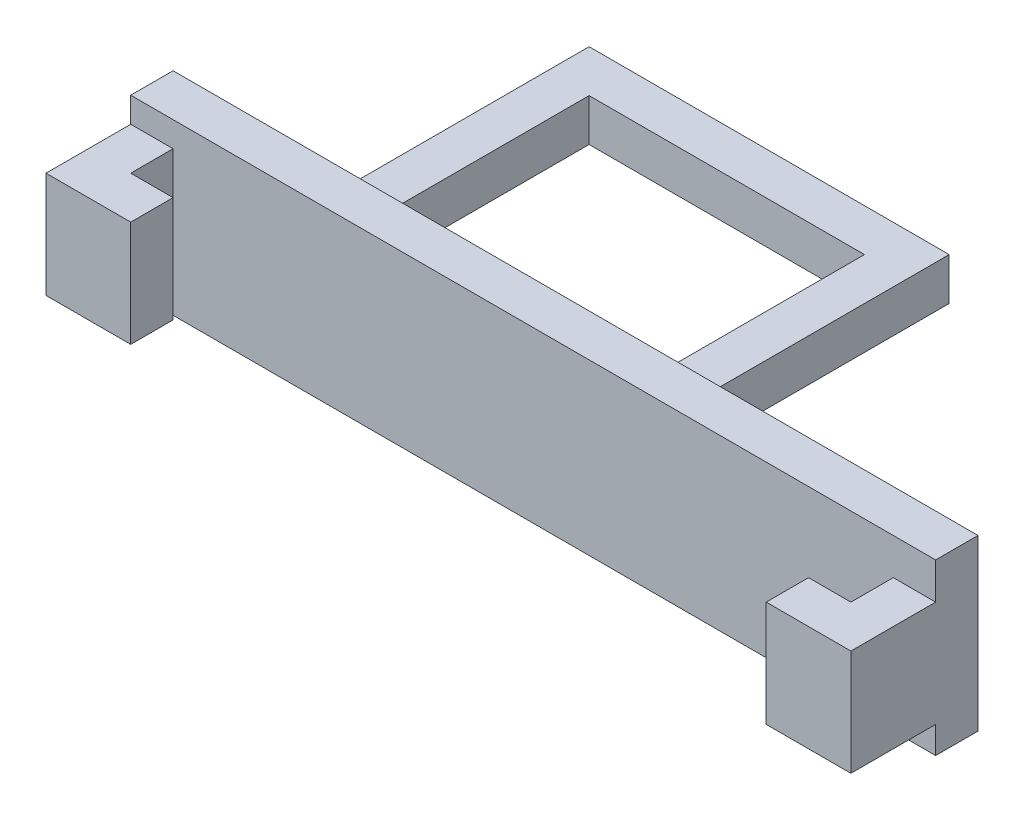
ISO-10303-21;
HEADER;
FILE_DESCRIPTION(('STEP AP214'),'2;1');
FILE_NAME('part.step','',(''),(''),'','','');
FILE_SCHEMA(('AUTOMOTIVE_DESIGN { 1 0 10303 214 1 1 1 1 }'));
ENDSEC;
DATA;
#1=APPLICATION_CONTEXT('core data for automotive mechanical design processes');
#2=APPLICATION_PROTOCOL_DEFINITION('international standard','automotive_design',2000,#1);
#3=PRODUCT_CONTEXT('',#1,'mechanical');
#4=PRODUCT('Part','Part','',(#3));
#5=PRODUCT_RELATED_PRODUCT_CATEGORY('part','',(#4));
#6=PRODUCT_DEFINITION_FORMATION('','',#4);
#7=PRODUCT_DEFINITION_CONTEXT('part definition',#1,'design');
#8=PRODUCT_DEFINITION('design','',#6,#7);
#9=PRODUCT_DEFINITION_SHAPE('','',#8);
#10=(LENGTH_UNIT() NAMED_UNIT(*) SI_UNIT(.MILLI.,.METRE.));
#11=(NAMED_UNIT(*) PLANE_ANGLE_UNIT() SI_UNIT($,.RADIAN.));
#12=(NAMED_UNIT(*) SI_UNIT($,.STERADIAN.) SOLID_ANGLE_UNIT());
#13=UNCERTAINTY_MEASURE_WITH_UNIT(LENGTH_MEASURE(1.E-05),#10,'distance_accuracy_value','');
#14=(GEOMETRIC_REPRESENTATION_CONTEXT(3) GLOBAL_UNCERTAINTY_ASSIGNED_CONTEXT((#13)) GLOBAL_UNIT_ASSIGNED_CONTEXT((#10,
#11,#12)) REPRESENTATION_CONTEXT('',''));
#15=CARTESIAN_POINT('',(0.,0.,0.));
#16=DIRECTION('',(0.,0.,1.));
#17=DIRECTION('',(1.,0.,0.));
#18=AXIS2_PLACEMENT_3D('',#15,#16,#17);
#19=CARTESIAN_POINT('',(30.3600841041871,0.,0.));
#20=DIRECTION('',(1.,0.,0.));
#21=DIRECTION('',(0.,0.,-1.));
#22=AXIS2_PLACEMENT_3D('',#19,#20,#21);
#23=PLANE('',#22);
#24=DIRECTION('',(0.,-1.,0.));
#25=VECTOR('',#24,1.);
#26=CARTESIAN_POINT('',(30.3600841041871,3.47182563135917,19.));
#27=LINE('',#26,#25);
#28=CARTESIAN_POINT('',(30.3600841041871,3.47182563135917,19.));
#29=VERTEX_POINT('',#28);
#30=CARTESIAN_POINT('',(30.3600841041871,-1.52817436864083,19.));
#31=VERTEX_POINT('',#30);
#32=EDGE_CURVE('E217',#29,#31,#27,.T.);
#33=ORIENTED_EDGE('',*,*,#32,.F.);
#34=DIRECTION('',(0.,0.,1.));
#35=VECTOR('',#34,1.);
#36=CARTESIAN_POINT('',(30.3600841041871,3.47182563135917,17.));
#37=LINE('',#36,#35);
#38=CARTESIAN_POINT('',(30.3600841041871,3.47182563135917,17.));
#39=VERTEX_POINT('',#38);
#40=EDGE_CURVE('E222',#39,#29,#37,.T.);
#41=ORIENTED_EDGE('',*,*,#40,.F.);
#42=DIRECTION('',(0.,1.,0.));
#43=VECTOR('',#42,1.);
#44=CARTESIAN_POINT('',(30.3600841041871,3.47182563135917,17.));
#45=LINE('',#44,#43);
#46=CARTESIAN_POINT('',(30.3600841041871,-1.52817436864083,17.));
#47=VERTEX_POINT('',#46);
#48=EDGE_CURVE('E271',#47,#39,#45,.T.);
#49=ORIENTED_EDGE('',*,*,#48,.F.);
#50=DIRECTION('',(0.,0.,-1.));
#51=VECTOR('',#50,1.);
#52=CARTESIAN_POINT('',(30.3600841041871,-1.52817436864083,17.));
#53=LINE('',#52,#51);
#54=EDGE_CURVE('E268',#31,#47,#53,.T.);
#55=ORIENTED_EDGE('',*,*,#54,.F.);
#56=EDGE_LOOP('',(#33,#41,#49,#55));
#57=FACE_BOUND('',#56,.T.);
#58=ADVANCED_FACE('F33',(#57),#23,.F.);
#59=CARTESIAN_POINT('',(-3.63991589581292,0.,0.));
#60=DIRECTION('',(-1.,0.,0.));
#61=DIRECTION('',(0.,0.,1.));
#62=AXIS2_PLACEMENT_3D('',#59,#60,#61);
#63=PLANE('',#62);
#64=DIRECTION('',(0.,1.,0.));
#65=VECTOR('',#64,1.);
#66=CARTESIAN_POINT('',(-3.63991589581292,4.00838379401158,19.));
#67=LINE('',#66,#65);
#68=CARTESIAN_POINT('',(-3.63991589581292,-0.99161620598842,19.));
#69=VERTEX_POINT('',#68);
#70=CARTESIAN_POINT('',(-3.63991589581292,4.00838379401158,19.));
#71=VERTEX_POINT('',#70);
#72=EDGE_CURVE('E50',#69,#71,#67,.T.);
#73=ORIENTED_EDGE('',*,*,#72,.F.);
#74=DIRECTION('',(0.,0.,1.));
#75=VECTOR('',#74,1.);
#76=CARTESIAN_POINT('',(-3.63991589581292,-0.991616205988421,17.));
#77=LINE('',#76,#75);
#78=CARTESIAN_POINT('',(-3.63991589581292,-0.991616205988421,17.));
#79=VERTEX_POINT('',#78);
#80=EDGE_CURVE('E244',#79,#69,#77,.T.);
#81=ORIENTED_EDGE('',*,*,#80,.F.);
#82=DIRECTION('',(0.,-1.,0.));
#83=VECTOR('',#82,1.);
#84=CARTESIAN_POINT('',(-3.63991589581292,-0.991616205988421,17.));
#85=LINE('',#84,#83);
#86=CARTESIAN_POINT('',(-3.63991589581292,4.00838379401158,17.));
#87=VERTEX_POINT('',#86);
#88=EDGE_CURVE('E248',#87,#79,#85,.T.);
#89=ORIENTED_EDGE('',*,*,#88,.F.);
#90=DIRECTION('',(0.,0.,-1.));
#91=VECTOR('',#90,1.);
#92=CARTESIAN_POINT('',(-3.63991589581292,4.00838379401158,17.));
#93=LINE('',#92,#91);
#94=EDGE_CURVE('E57',#71,#87,#93,.T.);
#95=ORIENTED_EDGE('',*,*,#94,.F.);
#96=EDGE_LOOP('',(#73,#81,#89,#95));
#97=FACE_BOUND('',#96,.T.);
#98=ADVANCED_FACE('F459',(#97),#63,.F.);
#99=CARTESIAN_POINT('',(0.,0.,17.));
#100=DIRECTION('',(0.,0.,-1.));
#101=DIRECTION('',(-1.,0.,0.));
#102=AXIS2_PLACEMENT_3D('',#99,#100,#101);
#103=PLANE('',#102);
#104=ORIENTED_EDGE('',*,*,#88,.T.);
#105=DIRECTION('',(-1.,0.,0.));
#106=VECTOR('',#105,1.);
#107=CARTESIAN_POINT('',(-3.63991589581292,-0.991616205988421,17.));
#108=LINE('',#107,#106);
#109=CARTESIAN_POINT('',(-5.63991589581292,-0.991616205988421,17.));
#110=VERTEX_POINT('',#109);
#111=EDGE_CURVE('E258',#79,#110,#108,.T.);
#112=ORIENTED_EDGE('',*,*,#111,.T.);
#113=DIRECTION('',(0.,-1.,0.));
#114=VECTOR('',#113,1.);
#115=CARTESIAN_POINT('',(-5.63991589581292,5.19652768965261,17.));
#116=LINE('',#115,#114);
#117=CARTESIAN_POINT('',(-5.63991589581292,-2.80347231034739,17.));
#118=VERTEX_POINT('',#117);
#119=EDGE_CURVE('E728',#110,#118,#116,.T.);
#120=ORIENTED_EDGE('',*,*,#119,.T.);
#121=DIRECTION('',(1.,0.,0.));
#122=VECTOR('',#121,1.);
#123=CARTESIAN_POINT('',(-5.63991589581292,-2.80347231034739,17.));
#124=LINE('',#123,#122);
#125=CARTESIAN_POINT('',(32.3600841041871,-2.80347231034739,17.));
#126=VERTEX_POINT('',#125);
#127=EDGE_CURVE('E308',#118,#126,#124,.T.);
#128=ORIENTED_EDGE('',*,*,#127,.T.);
#129=DIRECTION('',(0.,1.,0.));
#130=VECTOR('',#129,1.);
#131=CARTESIAN_POINT('',(32.3600841041871,5.19652768965261,17.));
#132=LINE('',#131,#130);
#133=CARTESIAN_POINT('',(32.3600841041871,-1.52817436864083,17.));
#134=VERTEX_POINT('',#133);
#135=EDGE_CURVE('E300',#126,#134,#132,.T.);
#136=ORIENTED_EDGE('',*,*,#135,.T.);
#137=DIRECTION('',(1.,0.,0.));
#138=VECTOR('',#137,1.);
#139=CARTESIAN_POINT('',(30.3600841041871,-1.52817436864083,17.));
#140=LINE('',#139,#138);
#141=EDGE_CURVE('E288',#47,#134,#140,.T.);
#142=ORIENTED_EDGE('',*,*,#141,.F.);
#143=ORIENTED_EDGE('',*,*,#48,.T.);
#144=DIRECTION('',(1.,0.,0.));
#145=VECTOR('',#144,1.);
#146=CARTESIAN_POINT('',(30.3600841041871,3.47182563135917,17.));
#147=LINE('',#146,#145);
#148=CARTESIAN_POINT('',(32.3600841041871,3.47182563135917,17.));
#149=VERTEX_POINT('',#148);
#150=EDGE_CURVE('E283',#39,#149,#147,.T.);
#151=ORIENTED_EDGE('',*,*,#150,.T.);
#152=CARTESIAN_POINT('',(32.3600841041871,5.19652768965261,17.));
#153=VERTEX_POINT('',#152);
#154=EDGE_CURVE('E311',#149,#153,#132,.T.);
#155=ORIENTED_EDGE('',*,*,#154,.T.);
#156=DIRECTION('',(-1.,0.,0.));
#157=VECTOR('',#156,1.);
#158=CARTESIAN_POINT('',(-5.63991589581292,5.19652768965261,17.));
#159=LINE('',#158,#157);
#160=CARTESIAN_POINT('',(-5.63991589581292,5.19652768965261,17.));
#161=VERTEX_POINT('',#160);
#162=EDGE_CURVE('E334',#153,#161,#159,.T.);
#163=ORIENTED_EDGE('',*,*,#162,.T.);
#164=CARTESIAN_POINT('',(-5.63991589581292,4.00838379401158,17.));
#165=VERTEX_POINT('',#164);
#166=EDGE_CURVE('E726',#161,#165,#116,.T.);
#167=ORIENTED_EDGE('',*,*,#166,.T.);
#168=DIRECTION('',(-1.,0.,0.));
#169=VECTOR('',#168,1.);
#170=CARTESIAN_POINT('',(-3.63991589581292,4.00838379401158,17.));
#171=LINE('',#170,#169);
#172=EDGE_CURVE('E262',#87,#165,#171,.T.);
#173=ORIENTED_EDGE('',*,*,#172,.F.);
#174=EDGE_LOOP('',(#104,#112,#120,#128,#136,#142,#143,#151,#155,#163,#167,#173));
#175=FACE_BOUND('',#174,.T.);
#176=ADVANCED_FACE('F306',(#175),#103,.F.);
#177=CARTESIAN_POINT('',(16.,1.,2.));
#178=DIRECTION('',(0.,0.,-1.));
#179=DIRECTION('',(0.,1.,0.));
#180=AXIS2_PLACEMENT_3D('',#177,#178,#179);
#181=PLANE('',#180);
#182=DIRECTION('',(0.,-1.,0.));
#183=VECTOR('',#182,1.);
#184=CARTESIAN_POINT('',(14.,0.999999999999999,2.));
#185=LINE('',#184,#183);
#186=CARTESIAN_POINT('',(14.,0.999999999999999,2.));
#187=VERTEX_POINT('',#186);
#188=CARTESIAN_POINT('',(14.,-1.,2.));
#189=VERTEX_POINT('',#188);
#190=EDGE_CURVE('E343',#187,#189,#185,.T.);
#191=ORIENTED_EDGE('',*,*,#190,.F.);
#192=DIRECTION('',(-1.,0.,0.));
#193=VECTOR('',#192,1.);
#194=CARTESIAN_POINT('',(16.,1.,2.));
#195=LINE('',#194,#193);
#196=CARTESIAN_POINT('',(1.,1.,2.));
#197=VERTEX_POINT('',#196);
#198=EDGE_CURVE('E319',#187,#197,#195,.T.);
#199=ORIENTED_EDGE('',*,*,#198,.T.);
#200=DIRECTION('',(0.,-1.,0.));
#201=VECTOR('',#200,1.);
#202=CARTESIAN_POINT('',(1.,1.,2.));
#203=LINE('',#202,#201);
#204=CARTESIAN_POINT('',(1.,-1.,2.));
#205=VERTEX_POINT('',#204);
#206=EDGE_CURVE('E361',#197,#205,#203,.T.);
#207=ORIENTED_EDGE('',*,*,#206,.T.);
#208=DIRECTION('',(-1.,0.,0.));
#209=VECTOR('',#208,1.);
#210=CARTESIAN_POINT('',(16.,-1.,2.));
#211=LINE('',#210,#209);
#212=EDGE_CURVE('E370',#189,#205,#211,.T.);
#213=ORIENTED_EDGE('',*,*,#212,.F.);
#214=EDGE_LOOP('',(#191,#199,#207,#213));
#215=FACE_BOUND('',#214,.T.);
#216=ADVANCED_FACE('F435',(#215),#181,.F.);
#217=CARTESIAN_POINT('',(1.,-1.,15.));
#218=DIRECTION('',(-1.,0.,0.));
#219=DIRECTION('',(0.,0.,1.));
#220=AXIS2_PLACEMENT_3D('',#217,#218,#219);
#221=PLANE('',#220);
#222=ORIENTED_EDGE('',*,*,#206,.F.);
#223=DIRECTION('',(0.,0.,-1.));
#224=VECTOR('',#223,1.);
#225=CARTESIAN_POINT('',(1.,1.,15.));
#226=LINE('',#225,#224);
#227=CARTESIAN_POINT('',(1.,1.,15.));
#228=VERTEX_POINT('',#227);
#229=EDGE_CURVE('E11',#228,#197,#226,.T.);
#230=ORIENTED_EDGE('',*,*,#229,.F.);
#231=DIRECTION('',(0.,1.,0.));
#232=VECTOR('',#231,1.);
#233=CARTESIAN_POINT('',(1.,-1.,15.));
#234=LINE('',#233,#232);
#235=CARTESIAN_POINT('',(1.,-1.,15.));
#236=VERTEX_POINT('',#235);
#237=EDGE_CURVE('E373',#236,#228,#234,.T.);
#238=ORIENTED_EDGE('',*,*,#237,.F.);
#239=DIRECTION('',(0.,0.,-1.));
#240=VECTOR('',#239,1.);
#241=CARTESIAN_POINT('',(1.,-1.,15.));
#242=LINE('',#241,#240);
#243=EDGE_CURVE('E379',#236,#205,#242,.T.);
#244=ORIENTED_EDGE('',*,*,#243,.T.);
#245=EDGE_LOOP('',(#222,#230,#238,#244));
#246=FACE_BOUND('',#245,.T.);
#247=ADVANCED_FACE('F35',(#246),#221,.F.);
#248=CARTESIAN_POINT('',(-1.,1.,15.));
#249=DIRECTION('',(0.,-1.,0.));
#250=DIRECTION('',(0.,0.,-1.));
#251=AXIS2_PLACEMENT_3D('',#248,#249,#250);
#252=PLANE('',#251);
#253=DIRECTION('',(-1.,0.,0.));
#254=VECTOR('',#253,1.);
#255=CARTESIAN_POINT('',(-1.,1.,0.));
#256=LINE('',#255,#254);
#257=CARTESIAN_POINT('',(16.,1.,0.));
#258=VERTEX_POINT('',#257);
#259=CARTESIAN_POINT('',(-1.,1.,0.));
#260=VERTEX_POINT('',#259);
#261=EDGE_CURVE('E387',#258,#260,#256,.T.);
#262=ORIENTED_EDGE('',*,*,#261,.T.);
#263=DIRECTION('',(0.,0.,-1.));
#264=VECTOR('',#263,1.);
#265=CARTESIAN_POINT('',(-1.,1.,15.));
#266=LINE('',#265,#264);
#267=CARTESIAN_POINT('',(-1.,1.,15.));
#268=VERTEX_POINT('',#267);
#269=EDGE_CURVE('E42',#268,#260,#266,.T.);
#270=ORIENTED_EDGE('',*,*,#269,.F.);
#271=DIRECTION('',(-1.,0.,0.));
#272=VECTOR('',#271,1.);
#273=CARTESIAN_POINT('',(-1.,1.,15.));
#274=LINE('',#273,#272);
#275=EDGE_CURVE('E439',#228,#268,#274,.T.);
#276=ORIENTED_EDGE('',*,*,#275,.F.);
#277=ORIENTED_EDGE('',*,*,#229,.T.);
#278=ORIENTED_EDGE('',*,*,#198,.F.);
#279=DIRECTION('',(0.,0.,-1.));
#280=VECTOR('',#279,1.);
#281=CARTESIAN_POINT('',(14.,0.999999999999999,13.));
#282=LINE('',#281,#280);
#283=CARTESIAN_POINT('',(14.,0.999999999999999,13.));
#284=VERTEX_POINT('',#283);
#285=EDGE_CURVE('E359',#284,#187,#282,.T.);
#286=ORIENTED_EDGE('',*,*,#285,.F.);
#287=DIRECTION('',(-1.,0.,0.));
#288=VECTOR('',#287,1.);
#289=CARTESIAN_POINT('',(16.,1.,13.));
#290=LINE('',#289,#288);
#291=CARTESIAN_POINT('',(16.,1.,13.));
#292=VERTEX_POINT('',#291);
#293=EDGE_CURVE('E344',#292,#284,#290,.T.);
#294=ORIENTED_EDGE('',*,*,#293,.F.);
#295=DIRECTION('',(0.,0.,1.));
#296=VECTOR('',#295,1.);
#297=CARTESIAN_POINT('',(16.,1.,0.));
#298=LINE('',#297,#296);
#299=EDGE_CURVE('E362',#258,#292,#298,.T.);
#300=ORIENTED_EDGE('',*,*,#299,.F.);
#301=EDGE_LOOP('',(#262,#270,#276,#277,#278,#286,#294,#300));
#302=FACE_BOUND('',#301,.T.);
#303=ADVANCED_FACE('F431',(#302),#252,.F.);
#304=CARTESIAN_POINT('',(-1.,-1.,15.));
#305=DIRECTION('',(1.,0.,0.));
#306=DIRECTION('',(0.,0.,-1.));
#307=AXIS2_PLACEMENT_3D('',#304,#305,#306);
#308=PLANE('',#307);
#309=DIRECTION('',(0.,-1.,0.));
#310=VECTOR('',#309,1.);
#311=CARTESIAN_POINT('',(-1.,-1.,0.));
#312=LINE('',#311,#310);
#313=CARTESIAN_POINT('',(-1.,-1.,0.));
#314=VERTEX_POINT('',#313);
#315=EDGE_CURVE('E392',#260,#314,#312,.T.);
#316=ORIENTED_EDGE('',*,*,#315,.T.);
#317=DIRECTION('',(0.,0.,-1.));
#318=VECTOR('',#317,1.);
#319=CARTESIAN_POINT('',(-1.,-1.,15.));
#320=LINE('',#319,#318);
#321=CARTESIAN_POINT('',(-1.,-1.,15.));
#322=VERTEX_POINT('',#321);
#323=EDGE_CURVE('E405',#322,#314,#320,.T.);
#324=ORIENTED_EDGE('',*,*,#323,.F.);
#325=DIRECTION('',(0.,-1.,0.));
#326=VECTOR('',#325,1.);
#327=CARTESIAN_POINT('',(-1.,-1.,15.));
#328=LINE('',#327,#326);
#329=EDGE_CURVE('E415',#268,#322,#328,.T.);
#330=ORIENTED_EDGE('',*,*,#329,.F.);
#331=ORIENTED_EDGE('',*,*,#269,.T.);
#332=EDGE_LOOP('',(#316,#324,#330,#331));
#333=FACE_BOUND('',#332,.T.);
#334=ADVANCED_FACE('F413',(#333),#308,.F.);
#335=CARTESIAN_POINT('',(-1.,-1.,15.));
#336=DIRECTION('',(0.,1.,0.));
#337=DIRECTION('',(0.,0.,1.));
#338=AXIS2_PLACEMENT_3D('',#335,#336,#337);
#339=PLANE('',#338);
#340=DIRECTION('',(1.,0.,0.));
#341=VECTOR('',#340,1.);
#342=CARTESIAN_POINT('',(-1.,-1.,0.));
#343=LINE('',#342,#341);
#344=CARTESIAN_POINT('',(16.,-1.,0.));
#345=VERTEX_POINT('',#344);
#346=EDGE_CURVE('E397',#314,#345,#343,.T.);
#347=ORIENTED_EDGE('',*,*,#346,.T.);
#348=DIRECTION('',(0.,0.,-1.));
#349=VECTOR('',#348,1.);
#350=CARTESIAN_POINT('',(16.,-1.,0.));
#351=LINE('',#350,#349);
#352=CARTESIAN_POINT('',(16.,-1.,13.));
#353=VERTEX_POINT('',#352);
#354=EDGE_CURVE('E364',#353,#345,#351,.T.);
#355=ORIENTED_EDGE('',*,*,#354,.F.);
#356=DIRECTION('',(1.,0.,0.));
#357=VECTOR('',#356,1.);
#358=CARTESIAN_POINT('',(16.,-1.,13.));
#359=LINE('',#358,#357);
#360=CARTESIAN_POINT('',(14.,-1.,13.));
#361=VERTEX_POINT('',#360);
#362=EDGE_CURVE('E349',#361,#353,#359,.T.);
#363=ORIENTED_EDGE('',*,*,#362,.F.);
#364=DIRECTION('',(0.,0.,-1.));
#365=VECTOR('',#364,1.);
#366=CARTESIAN_POINT('',(14.,-1.,13.));
#367=LINE('',#366,#365);
#368=EDGE_CURVE('E355',#361,#189,#367,.T.);
#369=ORIENTED_EDGE('',*,*,#368,.T.);
#370=ORIENTED_EDGE('',*,*,#212,.T.);
#371=ORIENTED_EDGE('',*,*,#243,.F.);
#372=DIRECTION('',(1.,0.,0.));
#373=VECTOR('',#372,1.);
#374=CARTESIAN_POINT('',(-1.,-1.,15.));
#375=LINE('',#374,#373);
#376=EDGE_CURVE('E400',#322,#236,#375,.T.);
#377=ORIENTED_EDGE('',*,*,#376,.F.);
#378=ORIENTED_EDGE('',*,*,#323,.T.);
#379=EDGE_LOOP('',(#347,#355,#363,#369,#370,#371,#377,#378));
#380=FACE_BOUND('',#379,.T.);
#381=ADVANCED_FACE('F421',(#380),#339,.F.);
#382=CARTESIAN_POINT('',(0.,0.,0.));
#383=DIRECTION('',(0.,0.,-1.));
#384=DIRECTION('',(-1.,0.,0.));
#385=AXIS2_PLACEMENT_3D('',#382,#383,#384);
#386=PLANE('',#385);
#387=ORIENTED_EDGE('',*,*,#261,.F.);
#388=DIRECTION('',(0.,1.,0.));
#389=VECTOR('',#388,1.);
#390=CARTESIAN_POINT('',(16.,1.,0.));
#391=LINE('',#390,#389);
#392=EDGE_CURVE('E367',#345,#258,#391,.T.);
#393=ORIENTED_EDGE('',*,*,#392,.F.);
#394=ORIENTED_EDGE('',*,*,#346,.F.);
#395=ORIENTED_EDGE('',*,*,#315,.F.);
#396=EDGE_LOOP('',(#387,#393,#394,#395));
#397=FACE_BOUND('',#396,.T.);
#398=ADVANCED_FACE('F419',(#397),#386,.T.);
#399=CARTESIAN_POINT('',(16.,0.,0.));
#400=DIRECTION('',(1.,0.,0.));
#401=DIRECTION('',(0.,0.,-1.));
#402=AXIS2_PLACEMENT_3D('',#399,#400,#401);
#403=PLANE('',#402);
#404=ORIENTED_EDGE('',*,*,#299,.T.);
#405=DIRECTION('',(0.,1.,0.));
#406=VECTOR('',#405,1.);
#407=CARTESIAN_POINT('',(16.,1.,13.));
#408=LINE('',#407,#406);
#409=EDGE_CURVE('E352',#353,#292,#408,.T.);
#410=ORIENTED_EDGE('',*,*,#409,.F.);
#411=ORIENTED_EDGE('',*,*,#354,.T.);
#412=ORIENTED_EDGE('',*,*,#392,.T.);
#413=EDGE_LOOP('',(#404,#410,#411,#412));
#414=FACE_BOUND('',#413,.T.);
#415=ADVANCED_FACE('F426',(#414),#403,.T.);
#416=CARTESIAN_POINT('',(14.,0.999999999999999,13.));
#417=DIRECTION('',(1.,0.,0.));
#418=DIRECTION('',(0.,0.,-1.));
#419=AXIS2_PLACEMENT_3D('',#416,#417,#418);
#420=PLANE('',#419);
#421=ORIENTED_EDGE('',*,*,#190,.T.);
#422=ORIENTED_EDGE('',*,*,#368,.F.);
#423=DIRECTION('',(0.,-1.,0.));
#424=VECTOR('',#423,1.);
#425=CARTESIAN_POINT('',(14.,0.999999999999999,13.));
#426=LINE('',#425,#424);
#427=EDGE_CURVE('E347',#284,#361,#426,.T.);
#428=ORIENTED_EDGE('',*,*,#427,.F.);
#429=ORIENTED_EDGE('',*,*,#285,.T.);
#430=EDGE_LOOP('',(#421,#422,#428,#429));
#431=FACE_BOUND('',#430,.T.);
#432=ADVANCED_FACE('F433',(#431),#420,.F.);
#433=CARTESIAN_POINT('',(0.,0.,13.));
#434=DIRECTION('',(0.,0.,1.));
#435=DIRECTION('',(1.,0.,0.));
#436=AXIS2_PLACEMENT_3D('',#433,#434,#435);
#437=PLANE('',#436);
#438=ORIENTED_EDGE('',*,*,#293,.T.);
#439=ORIENTED_EDGE('',*,*,#427,.T.);
#440=ORIENTED_EDGE('',*,*,#362,.T.);
#441=ORIENTED_EDGE('',*,*,#409,.T.);
#442=EDGE_LOOP('',(#438,#439,#440,#441));
#443=FACE_BOUND('',#442,.T.);
#444=ADVANCED_FACE('F429',(#443),#437,.T.);
#445=CARTESIAN_POINT('',(0.,0.,15.));
#446=DIRECTION('',(0.,0.,-1.));
#447=DIRECTION('',(-1.,0.,0.));
#448=AXIS2_PLACEMENT_3D('',#445,#446,#447);
#449=PLANE('',#448);
#450=DIRECTION('',(-1.,0.,0.));
#451=VECTOR('',#450,1.);
#452=CARTESIAN_POINT('',(-5.63991589581292,5.19652768965261,15.));
#453=LINE('',#452,#451);
#454=CARTESIAN_POINT('',(32.3600841041871,5.19652768965261,15.));
#455=VERTEX_POINT('',#454);
#456=CARTESIAN_POINT('',(-5.63991589581292,5.19652768965261,15.));
#457=VERTEX_POINT('',#456);
#458=EDGE_CURVE('E287',#455,#457,#453,.T.);
#459=ORIENTED_EDGE('',*,*,#458,.F.);
#460=DIRECTION('',(0.,1.,0.));
#461=VECTOR('',#460,1.);
#462=CARTESIAN_POINT('',(32.3600841041871,5.19652768965261,15.));
#463=LINE('',#462,#461);
#464=CARTESIAN_POINT('',(32.3600841041871,-2.80347231034739,15.));
#465=VERTEX_POINT('',#464);
#466=EDGE_CURVE('E333',#465,#455,#463,.T.);
#467=ORIENTED_EDGE('',*,*,#466,.F.);
#468=DIRECTION('',(1.,0.,0.));
#469=VECTOR('',#468,1.);
#470=CARTESIAN_POINT('',(-5.63991589581292,-2.80347231034739,15.));
#471=LINE('',#470,#469);
#472=CARTESIAN_POINT('',(-5.63991589581292,-2.80347231034739,15.));
#473=VERTEX_POINT('',#472);
#474=EDGE_CURVE('E331',#473,#465,#471,.T.);
#475=ORIENTED_EDGE('',*,*,#474,.F.);
#476=DIRECTION('',(0.,-1.,0.));
#477=VECTOR('',#476,1.);
#478=CARTESIAN_POINT('',(-5.63991589581292,5.19652768965261,15.));
#479=LINE('',#478,#477);
#480=EDGE_CURVE('E329',#457,#473,#479,.T.);
#481=ORIENTED_EDGE('',*,*,#480,.F.);
#482=EDGE_LOOP('',(#459,#467,#475,#481));
#483=FACE_BOUND('',#482,.T.);
#484=ORIENTED_EDGE('',*,*,#237,.T.);
#485=ORIENTED_EDGE('',*,*,#275,.T.);
#486=ORIENTED_EDGE('',*,*,#329,.T.);
#487=ORIENTED_EDGE('',*,*,#376,.T.);
#488=EDGE_LOOP('',(#484,#485,#486,#487));
#489=FACE_BOUND('',#488,.T.);
#490=ADVANCED_FACE('F442',(#483,#489),#449,.T.);
#491=CARTESIAN_POINT('',(-5.63991589581292,5.19652768965261,17.));
#492=DIRECTION('',(0.,-1.,0.));
#493=DIRECTION('',(0.,0.,-1.));
#494=AXIS2_PLACEMENT_3D('',#491,#492,#493);
#495=PLANE('',#494);
#496=ORIENTED_EDGE('',*,*,#458,.T.);
#497=DIRECTION('',(0.,0.,-1.));
#498=VECTOR('',#497,1.);
#499=CARTESIAN_POINT('',(-5.63991589581292,5.19652768965261,17.));
#500=LINE('',#499,#498);
#501=EDGE_CURVE('E340',#161,#457,#500,.T.);
#502=ORIENTED_EDGE('',*,*,#501,.F.);
#503=ORIENTED_EDGE('',*,*,#162,.F.);
#504=DIRECTION('',(0.,0.,-1.));
#505=VECTOR('',#504,1.);
#506=CARTESIAN_POINT('',(32.3600841041871,5.19652768965261,17.));
#507=LINE('',#506,#505);
#508=EDGE_CURVE('E310',#153,#455,#507,.T.);
#509=ORIENTED_EDGE('',*,*,#508,.T.);
#510=EDGE_LOOP('',(#496,#502,#503,#509));
#511=FACE_BOUND('',#510,.T.);
#512=ADVANCED_FACE('F444',(#511),#495,.F.);
#513=CARTESIAN_POINT('',(-5.63991589581292,5.19652768965261,17.));
#514=DIRECTION('',(1.,0.,0.));
#515=DIRECTION('',(0.,0.,-1.));
#516=AXIS2_PLACEMENT_3D('',#513,#514,#515);
#517=PLANE('',#516);
#518=ORIENTED_EDGE('',*,*,#480,.T.);
#519=DIRECTION('',(0.,0.,-1.));
#520=VECTOR('',#519,1.);
#521=CARTESIAN_POINT('',(-5.63991589581292,-2.80347231034739,17.));
#522=LINE('',#521,#520);
#523=EDGE_CURVE('E337',#118,#473,#522,.T.);
#524=ORIENTED_EDGE('',*,*,#523,.F.);
#525=ORIENTED_EDGE('',*,*,#119,.F.);
#526=DIRECTION('',(0.,0.,1.));
#527=VECTOR('',#526,1.);
#528=CARTESIAN_POINT('',(-5.63991589581292,-0.991616205988421,17.));
#529=LINE('',#528,#527);
#530=CARTESIAN_POINT('',(-5.63991589581292,-0.991616205988419,21.));
#531=VERTEX_POINT('',#530);
#532=EDGE_CURVE('E243',#110,#531,#529,.T.);
#533=ORIENTED_EDGE('',*,*,#532,.T.);
#534=DIRECTION('',(0.,1.,0.));
#535=VECTOR('',#534,1.);
#536=CARTESIAN_POINT('',(-5.63991589581292,-0.991616205988419,21.));
#537=LINE('',#536,#535);
#538=CARTESIAN_POINT('',(-5.63991589581292,4.00838379401158,21.));
#539=VERTEX_POINT('',#538);
#540=EDGE_CURVE('E253',#531,#539,#537,.T.);
#541=ORIENTED_EDGE('',*,*,#540,.T.);
#542=DIRECTION('',(0.,0.,-1.));
#543=VECTOR('',#542,1.);
#544=CARTESIAN_POINT('',(-5.63991589581292,4.00838379401158,17.));
#545=LINE('',#544,#543);
#546=EDGE_CURVE('E246',#539,#165,#545,.T.);
#547=ORIENTED_EDGE('',*,*,#546,.T.);
#548=ORIENTED_EDGE('',*,*,#166,.F.);
#549=ORIENTED_EDGE('',*,*,#501,.T.);
#550=EDGE_LOOP('',(#518,#524,#525,#533,#541,#547,#548,#549));
#551=FACE_BOUND('',#550,.T.);
#552=ADVANCED_FACE('F451',(#551),#517,.F.);
#553=CARTESIAN_POINT('',(-5.63991589581292,-2.80347231034739,17.));
#554=DIRECTION('',(0.,1.,0.));
#555=DIRECTION('',(0.,0.,1.));
#556=AXIS2_PLACEMENT_3D('',#553,#554,#555);
#557=PLANE('',#556);
#558=ORIENTED_EDGE('',*,*,#474,.T.);
#559=DIRECTION('',(0.,0.,-1.));
#560=VECTOR('',#559,1.);
#561=CARTESIAN_POINT('',(32.3600841041871,-2.80347231034739,17.));
#562=LINE('',#561,#560);
#563=EDGE_CURVE('E314',#126,#465,#562,.T.);
#564=ORIENTED_EDGE('',*,*,#563,.F.);
#565=ORIENTED_EDGE('',*,*,#127,.F.);
#566=ORIENTED_EDGE('',*,*,#523,.T.);
#567=EDGE_LOOP('',(#558,#564,#565,#566));
#568=FACE_BOUND('',#567,.T.);
#569=ADVANCED_FACE('F583',(#568),#557,.F.);
#570=CARTESIAN_POINT('',(32.3600841041871,5.19652768965261,17.));
#571=DIRECTION('',(-1.,0.,0.));
#572=DIRECTION('',(0.,0.,1.));
#573=AXIS2_PLACEMENT_3D('',#570,#571,#572);
#574=PLANE('',#573);
#575=ORIENTED_EDGE('',*,*,#466,.T.);
#576=ORIENTED_EDGE('',*,*,#508,.F.);
#577=ORIENTED_EDGE('',*,*,#154,.F.);
#578=DIRECTION('',(0.,0.,1.));
#579=VECTOR('',#578,1.);
#580=CARTESIAN_POINT('',(32.3600841041871,3.47182563135917,17.));
#581=LINE('',#580,#579);
#582=CARTESIAN_POINT('',(32.3600841041871,3.47182563135917,21.));
#583=VERTEX_POINT('',#582);
#584=EDGE_CURVE('E261',#149,#583,#581,.T.);
#585=ORIENTED_EDGE('',*,*,#584,.T.);
#586=DIRECTION('',(0.,-1.,0.));
#587=VECTOR('',#586,1.);
#588=CARTESIAN_POINT('',(32.3600841041871,3.47182563135917,21.));
#589=LINE('',#588,#587);
#590=CARTESIAN_POINT('',(32.3600841041871,-1.52817436864083,21.));
#591=VERTEX_POINT('',#590);
#592=EDGE_CURVE('E275',#583,#591,#589,.T.);
#593=ORIENTED_EDGE('',*,*,#592,.T.);
#594=DIRECTION('',(0.,0.,-1.));
#595=VECTOR('',#594,1.);
#596=CARTESIAN_POINT('',(32.3600841041871,-1.52817436864083,17.));
#597=LINE('',#596,#595);
#598=EDGE_CURVE('E269',#591,#134,#597,.T.);
#599=ORIENTED_EDGE('',*,*,#598,.T.);
#600=ORIENTED_EDGE('',*,*,#135,.F.);
#601=ORIENTED_EDGE('',*,*,#563,.T.);
#602=EDGE_LOOP('',(#575,#576,#577,#585,#593,#599,#600,#601));
#603=FACE_BOUND('',#602,.T.);
#604=ADVANCED_FACE('F298',(#603),#574,.F.);
#605=CARTESIAN_POINT('',(30.3600841041871,3.47182563135917,17.));
#606=DIRECTION('',(0.,1.,0.));
#607=DIRECTION('',(0.,0.,1.));
#608=AXIS2_PLACEMENT_3D('',#605,#606,#607);
#609=PLANE('',#608);
#610=ORIENTED_EDGE('',*,*,#584,.F.);
#611=ORIENTED_EDGE('',*,*,#150,.F.);
#612=ORIENTED_EDGE('',*,*,#40,.T.);
#613=DIRECTION('',(1.,0.,0.));
#614=VECTOR('',#613,1.);
#615=CARTESIAN_POINT('',(28.3600841041871,3.47182563135917,19.));
#616=LINE('',#615,#614);
#617=CARTESIAN_POINT('',(28.3600841041871,3.47182563135917,19.));
#618=VERTEX_POINT('',#617);
#619=EDGE_CURVE('E201',#618,#29,#616,.T.);
#620=ORIENTED_EDGE('',*,*,#619,.F.);
#621=DIRECTION('',(0.,0.,-1.));
#622=VECTOR('',#621,1.);
#623=CARTESIAN_POINT('',(28.3600841041871,3.47182563135917,21.));
#624=LINE('',#623,#622);
#625=CARTESIAN_POINT('',(28.3600841041871,3.47182563135917,21.));
#626=VERTEX_POINT('',#625);
#627=EDGE_CURVE('E209',#626,#618,#624,.T.);
#628=ORIENTED_EDGE('',*,*,#627,.F.);
#629=DIRECTION('',(1.,0.,0.));
#630=VECTOR('',#629,1.);
#631=CARTESIAN_POINT('',(30.3600841041871,3.47182563135917,21.));
#632=LINE('',#631,#630);
#633=EDGE_CURVE('E274',#626,#583,#632,.T.);
#634=ORIENTED_EDGE('',*,*,#633,.T.);
#635=EDGE_LOOP('',(#610,#611,#612,#620,#628,#634));
#636=FACE_BOUND('',#635,.T.);
#637=ADVANCED_FACE('F220',(#636),#609,.T.);
#638=CARTESIAN_POINT('',(30.3600841041871,-1.52817436864083,17.));
#639=DIRECTION('',(0.,-1.,0.));
#640=DIRECTION('',(0.,0.,-1.));
#641=AXIS2_PLACEMENT_3D('',#638,#639,#640);
#642=PLANE('',#641);
#643=ORIENTED_EDGE('',*,*,#598,.F.);
#644=DIRECTION('',(1.,0.,0.));
#645=VECTOR('',#644,1.);
#646=CARTESIAN_POINT('',(30.3600841041871,-1.52817436864083,21.));
#647=LINE('',#646,#645);
#648=CARTESIAN_POINT('',(28.3600841041871,-1.52817436864083,21.));
#649=VERTEX_POINT('',#648);
#650=EDGE_CURVE('E280',#649,#591,#647,.T.);
#651=ORIENTED_EDGE('',*,*,#650,.F.);
#652=DIRECTION('',(0.,0.,1.));
#653=VECTOR('',#652,1.);
#654=CARTESIAN_POINT('',(28.3600841041871,-1.52817436864083,21.));
#655=LINE('',#654,#653);
#656=CARTESIAN_POINT('',(28.3600841041871,-1.52817436864083,19.));
#657=VERTEX_POINT('',#656);
#658=EDGE_CURVE('E208',#657,#649,#655,.T.);
#659=ORIENTED_EDGE('',*,*,#658,.F.);
#660=DIRECTION('',(1.,0.,0.));
#661=VECTOR('',#660,1.);
#662=CARTESIAN_POINT('',(28.3600841041871,-1.52817436864083,19.));
#663=LINE('',#662,#661);
#664=EDGE_CURVE('E204',#657,#31,#663,.T.);
#665=ORIENTED_EDGE('',*,*,#664,.T.);
#666=ORIENTED_EDGE('',*,*,#54,.T.);
#667=ORIENTED_EDGE('',*,*,#141,.T.);
#668=EDGE_LOOP('',(#643,#651,#659,#665,#666,#667));
#669=FACE_BOUND('',#668,.T.);
#670=ADVANCED_FACE('F470',(#669),#642,.T.);
#671=CARTESIAN_POINT('',(30.3600841041871,3.47182563135917,21.));
#672=DIRECTION('',(0.,0.,1.));
#673=DIRECTION('',(1.,0.,0.));
#674=AXIS2_PLACEMENT_3D('',#671,#672,#673);
#675=PLANE('',#674);
#676=ORIENTED_EDGE('',*,*,#592,.F.);
#677=ORIENTED_EDGE('',*,*,#633,.F.);
#678=DIRECTION('',(0.,1.,0.));
#679=VECTOR('',#678,1.);
#680=CARTESIAN_POINT('',(28.3600841041871,3.47182563135917,21.));
#681=LINE('',#680,#679);
#682=EDGE_CURVE('E215',#649,#626,#681,.T.);
#683=ORIENTED_EDGE('',*,*,#682,.F.);
#684=ORIENTED_EDGE('',*,*,#650,.T.);
#685=EDGE_LOOP('',(#676,#677,#683,#684));
#686=FACE_BOUND('',#685,.T.);
#687=ADVANCED_FACE('F473',(#686),#675,.T.);
#688=CARTESIAN_POINT('',(-3.63991589581292,-0.991616205988421,17.));
#689=DIRECTION('',(0.,-1.,0.));
#690=DIRECTION('',(0.,0.,-1.));
#691=AXIS2_PLACEMENT_3D('',#688,#689,#690);
#692=PLANE('',#691);
#693=ORIENTED_EDGE('',*,*,#532,.F.);
#694=ORIENTED_EDGE('',*,*,#111,.F.);
#695=ORIENTED_EDGE('',*,*,#80,.T.);
#696=DIRECTION('',(-1.,0.,0.));
#697=VECTOR('',#696,1.);
#698=CARTESIAN_POINT('',(-1.63991589581292,-0.991616205988418,19.));
#699=LINE('',#698,#697);
#700=CARTESIAN_POINT('',(-1.63991589581292,-0.991616205988418,19.));
#701=VERTEX_POINT('',#700);
#702=EDGE_CURVE('E240',#701,#69,#699,.T.);
#703=ORIENTED_EDGE('',*,*,#702,.F.);
#704=DIRECTION('',(0.,0.,-1.));
#705=VECTOR('',#704,1.);
#706=CARTESIAN_POINT('',(-1.63991589581292,-0.991616205988419,21.));
#707=LINE('',#706,#705);
#708=CARTESIAN_POINT('',(-1.63991589581292,-0.991616205988419,21.));
#709=VERTEX_POINT('',#708);
#710=EDGE_CURVE('E234',#709,#701,#707,.T.);
#711=ORIENTED_EDGE('',*,*,#710,.F.);
#712=DIRECTION('',(-1.,0.,0.));
#713=VECTOR('',#712,1.);
#714=CARTESIAN_POINT('',(-3.63991589581292,-0.991616205988419,21.));
#715=LINE('',#714,#713);
#716=EDGE_CURVE('E250',#709,#531,#715,.T.);
#717=ORIENTED_EDGE('',*,*,#716,.T.);
#718=EDGE_LOOP('',(#693,#694,#695,#703,#711,#717));
#719=FACE_BOUND('',#718,.T.);
#720=ADVANCED_FACE('F468',(#719),#692,.T.);
#721=CARTESIAN_POINT('',(-3.63991589581292,4.00838379401158,17.));
#722=DIRECTION('',(0.,1.,0.));
#723=DIRECTION('',(0.,0.,1.));
#724=AXIS2_PLACEMENT_3D('',#721,#722,#723);
#725=PLANE('',#724);
#726=ORIENTED_EDGE('',*,*,#546,.F.);
#727=DIRECTION('',(-1.,0.,0.));
#728=VECTOR('',#727,1.);
#729=CARTESIAN_POINT('',(-3.63991589581292,4.00838379401158,21.));
#730=LINE('',#729,#728);
#731=CARTESIAN_POINT('',(-1.63991589581292,4.00838379401158,21.));
#732=VERTEX_POINT('',#731);
#733=EDGE_CURVE('E264',#732,#539,#730,.T.);
#734=ORIENTED_EDGE('',*,*,#733,.F.);
#735=DIRECTION('',(0.,0.,1.));
#736=VECTOR('',#735,1.);
#737=CARTESIAN_POINT('',(-1.63991589581292,4.00838379401158,21.));
#738=LINE('',#737,#736);
#739=CARTESIAN_POINT('',(-1.63991589581292,4.00838379401158,19.));
#740=VERTEX_POINT('',#739);
#741=EDGE_CURVE('E224',#740,#732,#738,.T.);
#742=ORIENTED_EDGE('',*,*,#741,.F.);
#743=DIRECTION('',(-1.,0.,0.));
#744=VECTOR('',#743,1.);
#745=CARTESIAN_POINT('',(-1.63991589581292,4.00838379401158,19.));
#746=LINE('',#745,#744);
#747=EDGE_CURVE('E237',#740,#71,#746,.T.);
#748=ORIENTED_EDGE('',*,*,#747,.T.);
#749=ORIENTED_EDGE('',*,*,#94,.T.);
#750=ORIENTED_EDGE('',*,*,#172,.T.);
#751=EDGE_LOOP('',(#726,#734,#742,#748,#749,#750));
#752=FACE_BOUND('',#751,.T.);
#753=ADVANCED_FACE('F625',(#752),#725,.T.);
#754=CARTESIAN_POINT('',(-3.63991589581292,-0.991616205988419,21.));
#755=DIRECTION('',(0.,0.,1.));
#756=DIRECTION('',(1.,0.,0.));
#757=AXIS2_PLACEMENT_3D('',#754,#755,#756);
#758=PLANE('',#757);
#759=ORIENTED_EDGE('',*,*,#540,.F.);
#760=ORIENTED_EDGE('',*,*,#716,.F.);
#761=DIRECTION('',(0.,-1.,0.));
#762=VECTOR('',#761,1.);
#763=CARTESIAN_POINT('',(-1.63991589581292,4.00838379401158,21.));
#764=LINE('',#763,#762);
#765=EDGE_CURVE('E231',#732,#709,#764,.T.);
#766=ORIENTED_EDGE('',*,*,#765,.F.);
#767=ORIENTED_EDGE('',*,*,#733,.T.);
#768=EDGE_LOOP('',(#759,#760,#766,#767));
#769=FACE_BOUND('',#768,.T.);
#770=ADVANCED_FACE('F634',(#769),#758,.T.);
#771=CARTESIAN_POINT('',(-1.63991589581292,4.00838379401158,19.));
#772=DIRECTION('',(0.,0.,1.));
#773=DIRECTION('',(1.,0.,0.));
#774=AXIS2_PLACEMENT_3D('',#771,#772,#773);
#775=PLANE('',#774);
#776=ORIENTED_EDGE('',*,*,#72,.T.);
#777=ORIENTED_EDGE('',*,*,#747,.F.);
#778=DIRECTION('',(0.,1.,0.));
#779=VECTOR('',#778,1.);
#780=CARTESIAN_POINT('',(-1.63991589581292,4.00838379401158,19.));
#781=LINE('',#780,#779);
#782=EDGE_CURVE('E236',#701,#740,#781,.T.);
#783=ORIENTED_EDGE('',*,*,#782,.F.);
#784=ORIENTED_EDGE('',*,*,#702,.T.);
#785=EDGE_LOOP('',(#776,#777,#783,#784));
#786=FACE_BOUND('',#785,.T.);
#787=ADVANCED_FACE('F644',(#786),#775,.F.);
#788=CARTESIAN_POINT('',(-1.63991589581292,0.,0.));
#789=DIRECTION('',(-1.,0.,0.));
#790=DIRECTION('',(0.,0.,1.));
#791=AXIS2_PLACEMENT_3D('',#788,#789,#790);
#792=PLANE('',#791);
#793=ORIENTED_EDGE('',*,*,#741,.T.);
#794=ORIENTED_EDGE('',*,*,#765,.T.);
#795=ORIENTED_EDGE('',*,*,#710,.T.);
#796=ORIENTED_EDGE('',*,*,#782,.T.);
#797=EDGE_LOOP('',(#793,#794,#795,#796));
#798=FACE_BOUND('',#797,.T.);
#799=ADVANCED_FACE('F653',(#798),#792,.F.);
#800=CARTESIAN_POINT('',(28.3600841041871,3.47182563135917,19.));
#801=DIRECTION('',(0.,0.,1.));
#802=DIRECTION('',(1.,0.,0.));
#803=AXIS2_PLACEMENT_3D('',#800,#801,#802);
#804=PLANE('',#803);
#805=ORIENTED_EDGE('',*,*,#32,.T.);
#806=ORIENTED_EDGE('',*,*,#664,.F.);
#807=DIRECTION('',(0.,-1.,0.));
#808=VECTOR('',#807,1.);
#809=CARTESIAN_POINT('',(28.3600841041871,3.47182563135917,19.));
#810=LINE('',#809,#808);
#811=EDGE_CURVE('E197',#618,#657,#810,.T.);
#812=ORIENTED_EDGE('',*,*,#811,.F.);
#813=ORIENTED_EDGE('',*,*,#619,.T.);
#814=EDGE_LOOP('',(#805,#806,#812,#813));
#815=FACE_BOUND('',#814,.T.);
#816=ADVANCED_FACE('F199',(#815),#804,.F.);
#817=CARTESIAN_POINT('',(28.3600841041871,0.,0.));
#818=DIRECTION('',(-1.,0.,0.));
#819=DIRECTION('',(0.,0.,1.));
#820=AXIS2_PLACEMENT_3D('',#817,#818,#819);
#821=PLANE('',#820);
#822=ORIENTED_EDGE('',*,*,#627,.T.);
#823=ORIENTED_EDGE('',*,*,#811,.T.);
#824=ORIENTED_EDGE('',*,*,#658,.T.);
#825=ORIENTED_EDGE('',*,*,#682,.T.);
#826=EDGE_LOOP('',(#822,#823,#824,#825));
#827=FACE_BOUND('',#826,.T.);
#828=ADVANCED_FACE('F213',(#827),#821,.T.);
#829=CLOSED_SHELL('',(#58,#98,#176,#216,#247,#303,#334,#381,#398,#415,#432,#444,#490,#512,#552,
#569,#604,#637,#670,#687,#720,#753,#770,#787,#799,#816,#828));
#830=MANIFOLD_SOLID_BREP('B2',#829);
#831=ADVANCED_BREP_SHAPE_REPRESENTATION('',(#18,#830),#14);
#832=SHAPE_DEFINITION_REPRESENTATION(#9,#831);
ENDSEC;
END-ISO-10303-21;
